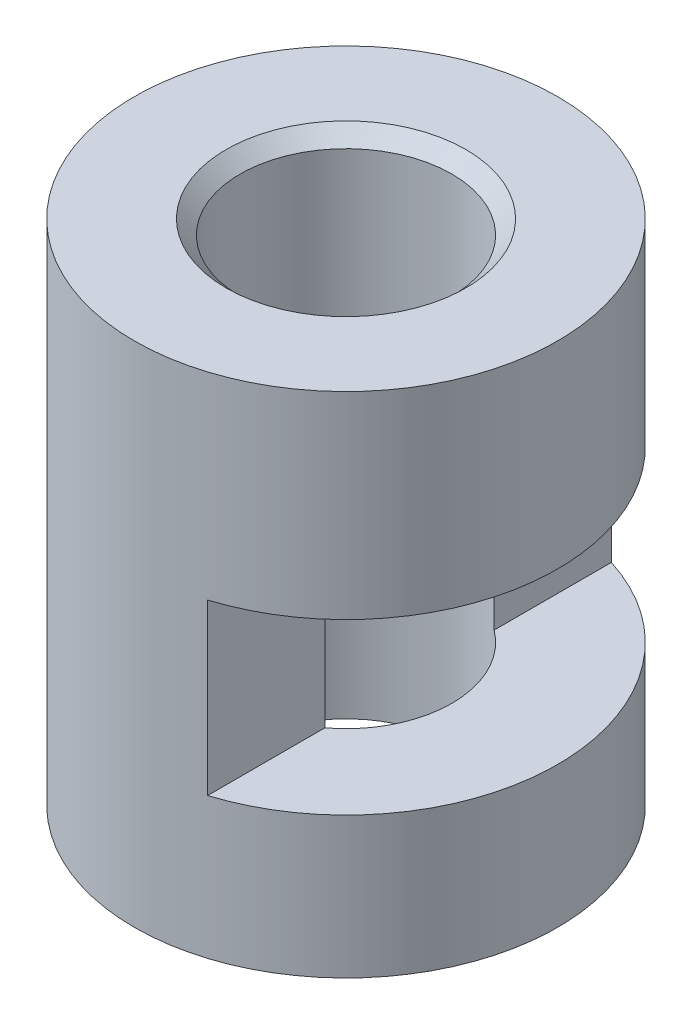
ISO-10303-21;
HEADER;
FILE_DESCRIPTION(('STEP AP214'),'2;1');
FILE_NAME('part.step','',(''),(''),'','','');
FILE_SCHEMA(('AUTOMOTIVE_DESIGN { 1 0 10303 214 1 1 1 1 }'));
ENDSEC;
DATA;
#1=APPLICATION_CONTEXT('core data for automotive mechanical design processes');
#2=APPLICATION_PROTOCOL_DEFINITION('international standard','automotive_design',2000,#1);
#3=PRODUCT_CONTEXT('',#1,'mechanical');
#4=PRODUCT('Part','Part','',(#3));
#5=PRODUCT_RELATED_PRODUCT_CATEGORY('part','',(#4));
#6=PRODUCT_DEFINITION_FORMATION('','',#4);
#7=PRODUCT_DEFINITION_CONTEXT('part definition',#1,'design');
#8=PRODUCT_DEFINITION('design','',#6,#7);
#9=PRODUCT_DEFINITION_SHAPE('','',#8);
#10=(LENGTH_UNIT() NAMED_UNIT(*) SI_UNIT(.MILLI.,.METRE.));
#11=(NAMED_UNIT(*) PLANE_ANGLE_UNIT() SI_UNIT($,.RADIAN.));
#12=(NAMED_UNIT(*) SI_UNIT($,.STERADIAN.) SOLID_ANGLE_UNIT());
#13=UNCERTAINTY_MEASURE_WITH_UNIT(LENGTH_MEASURE(1.E-05),#10,'distance_accuracy_value','');
#14=(GEOMETRIC_REPRESENTATION_CONTEXT(3) GLOBAL_UNCERTAINTY_ASSIGNED_CONTEXT((#13)) GLOBAL_UNIT_ASSIGNED_CONTEXT((#10,
#11,#12)) REPRESENTATION_CONTEXT('',''));
#15=CARTESIAN_POINT('',(0.,0.,0.));
#16=DIRECTION('',(0.,0.,1.));
#17=DIRECTION('',(1.,0.,0.));
#18=AXIS2_PLACEMENT_3D('',#15,#16,#17);
#19=CARTESIAN_POINT('',(0.,7.2,0.));
#20=DIRECTION('',(0.,-1.,0.));
#21=DIRECTION('',(0.,0.,-1.));
#22=AXIS2_PLACEMENT_3D('',#19,#20,#21);
#23=CYLINDRICAL_SURFACE('',#22,3.);
#24=DIRECTION('',(0.,-1.,0.));
#25=VECTOR('',#24,1.);
#26=CARTESIAN_POINT('',(0.899999999999999,7.2,2.86181760425084));
#27=LINE('',#26,#25);
#28=CARTESIAN_POINT('',(0.9,2.,2.86181760425084));
#29=VERTEX_POINT('',#28);
#30=CARTESIAN_POINT('',(0.899999999999999,4.4,2.86181760425084));
#31=VERTEX_POINT('',#30);
#32=EDGE_CURVE('E108',#29,#31,#27,.F.);
#33=ORIENTED_EDGE('',*,*,#32,.T.);
#34=CARTESIAN_POINT('',(0.,4.4,0.));
#35=DIRECTION('',(0.,1.,0.));
#36=DIRECTION('',(0.,0.,1.));
#37=AXIS2_PLACEMENT_3D('',#34,#35,#36);
#38=CIRCLE('',#37,3.);
#39=CARTESIAN_POINT('',(0.899999999999999,4.4,-2.86181760425084));
#40=VERTEX_POINT('',#39);
#41=EDGE_CURVE('E92',#31,#40,#38,.T.);
#42=ORIENTED_EDGE('',*,*,#41,.T.);
#43=DIRECTION('',(0.,-1.,0.));
#44=VECTOR('',#43,1.);
#45=CARTESIAN_POINT('',(0.899999999999999,7.2,-2.86181760425084));
#46=LINE('',#45,#44);
#47=CARTESIAN_POINT('',(0.9,2.,-2.86181760425084));
#48=VERTEX_POINT('',#47);
#49=EDGE_CURVE('E99',#40,#48,#46,.T.);
#50=ORIENTED_EDGE('',*,*,#49,.T.);
#51=CARTESIAN_POINT('',(0.,2.,0.));
#52=DIRECTION('',(0.,-1.,0.));
#53=DIRECTION('',(0.,0.,-1.));
#54=AXIS2_PLACEMENT_3D('',#51,#52,#53);
#55=CIRCLE('',#54,3.);
#56=EDGE_CURVE('E64',#48,#29,#55,.T.);
#57=ORIENTED_EDGE('',*,*,#56,.T.);
#58=EDGE_LOOP('',(#33,#42,#50,#57));
#59=FACE_BOUND('',#58,.T.);
#60=CARTESIAN_POINT('',(0.,7.2,0.));
#61=DIRECTION('',(0.,1.,0.));
#62=DIRECTION('',(0.,0.,1.));
#63=AXIS2_PLACEMENT_3D('',#60,#61,#62);
#64=CIRCLE('',#63,3.);
#65=CARTESIAN_POINT('',(0.,7.2,3.));
#66=VERTEX_POINT('',#65);
#67=EDGE_CURVE('E116',#66,#66,#64,.T.);
#68=ORIENTED_EDGE('',*,*,#67,.F.);
#69=EDGE_LOOP('',(#68));
#70=FACE_BOUND('',#69,.T.);
#71=CARTESIAN_POINT('',(0.,0.,0.));
#72=DIRECTION('',(0.,1.,0.));
#73=DIRECTION('',(0.,0.,1.));
#74=AXIS2_PLACEMENT_3D('',#71,#72,#73);
#75=CIRCLE('',#74,3.);
#76=CARTESIAN_POINT('',(0.,0.,3.));
#77=VERTEX_POINT('',#76);
#78=EDGE_CURVE('E111',#77,#77,#75,.T.);
#79=ORIENTED_EDGE('',*,*,#78,.T.);
#80=EDGE_LOOP('',(#79));
#81=FACE_BOUND('',#80,.T.);
#82=ADVANCED_FACE('F49',(#59,#70,#81),#23,.T.);
#83=CARTESIAN_POINT('',(0.,7.2,0.));
#84=DIRECTION('',(0.,1.,0.));
#85=DIRECTION('',(0.,0.,1.));
#86=AXIS2_PLACEMENT_3D('',#83,#84,#85);
#87=PLANE('',#86);
#88=CARTESIAN_POINT('',(0.,7.2,0.));
#89=DIRECTION('',(0.,1.,0.));
#90=DIRECTION('',(0.,0.,1.));
#91=AXIS2_PLACEMENT_3D('',#88,#89,#90);
#92=CIRCLE('',#91,1.7);
#93=CARTESIAN_POINT('',(0.,7.2,1.7));
#94=VERTEX_POINT('',#93);
#95=EDGE_CURVE('E13',#94,#94,#92,.F.);
#96=ORIENTED_EDGE('',*,*,#95,.T.);
#97=EDGE_LOOP('',(#96));
#98=FACE_BOUND('',#97,.T.);
#99=ORIENTED_EDGE('',*,*,#67,.T.);
#100=EDGE_LOOP('',(#99));
#101=FACE_BOUND('',#100,.T.);
#102=ADVANCED_FACE('F144',(#98,#101),#87,.T.);
#103=CARTESIAN_POINT('',(0.,0.,0.));
#104=DIRECTION('',(0.,1.,0.));
#105=DIRECTION('',(0.,0.,1.));
#106=AXIS2_PLACEMENT_3D('',#103,#104,#105);
#107=PLANE('',#106);
#108=CARTESIAN_POINT('',(0.,0.,0.));
#109=DIRECTION('',(0.,1.,0.));
#110=DIRECTION('',(0.,0.,1.));
#111=AXIS2_PLACEMENT_3D('',#108,#109,#110);
#112=CIRCLE('',#111,1.5);
#113=CARTESIAN_POINT('',(0.,0.,1.5));
#114=VERTEX_POINT('',#113);
#115=EDGE_CURVE('E107',#114,#114,#112,.F.);
#116=ORIENTED_EDGE('',*,*,#115,.F.);
#117=EDGE_LOOP('',(#116));
#118=FACE_BOUND('',#117,.T.);
#119=ORIENTED_EDGE('',*,*,#78,.F.);
#120=EDGE_LOOP('',(#119));
#121=FACE_BOUND('',#120,.T.);
#122=ADVANCED_FACE('F148',(#118,#121),#107,.F.);
#123=CARTESIAN_POINT('',(0.,-0.00100000000000013,0.));
#124=DIRECTION('',(0.,1.,0.));
#125=DIRECTION('',(0.,0.,1.));
#126=AXIS2_PLACEMENT_3D('',#123,#124,#125);
#127=CYLINDRICAL_SURFACE('',#126,1.5);
#128=CARTESIAN_POINT('',(0.,7.,0.));
#129=DIRECTION('',(0.,1.,0.));
#130=DIRECTION('',(0.,0.,1.));
#131=AXIS2_PLACEMENT_3D('',#128,#129,#130);
#132=CIRCLE('',#131,1.5);
#133=CARTESIAN_POINT('',(0.,7.,1.5));
#134=VERTEX_POINT('',#133);
#135=EDGE_CURVE('E57',#134,#134,#132,.T.);
#136=ORIENTED_EDGE('',*,*,#135,.T.);
#137=EDGE_LOOP('',(#136));
#138=FACE_BOUND('',#137,.T.);
#139=DIRECTION('',(0.,1.,0.));
#140=VECTOR('',#139,1.);
#141=CARTESIAN_POINT('',(0.9,-0.00100000000000001,-1.2));
#142=LINE('',#141,#140);
#143=CARTESIAN_POINT('',(0.9,2.,-1.2));
#144=VERTEX_POINT('',#143);
#145=CARTESIAN_POINT('',(0.899999999999999,4.4,-1.2));
#146=VERTEX_POINT('',#145);
#147=EDGE_CURVE('E102',#144,#146,#142,.T.);
#148=ORIENTED_EDGE('',*,*,#147,.T.);
#149=CARTESIAN_POINT('',(0.,4.4,0.));
#150=DIRECTION('',(0.,1.,0.));
#151=DIRECTION('',(0.,0.,1.));
#152=AXIS2_PLACEMENT_3D('',#149,#150,#151);
#153=CIRCLE('',#152,1.5);
#154=CARTESIAN_POINT('',(0.899999999999999,4.4,1.2));
#155=VERTEX_POINT('',#154);
#156=EDGE_CURVE('E127',#146,#155,#153,.F.);
#157=ORIENTED_EDGE('',*,*,#156,.T.);
#158=DIRECTION('',(0.,1.,0.));
#159=VECTOR('',#158,1.);
#160=CARTESIAN_POINT('',(0.9,-0.00100000000000001,1.2));
#161=LINE('',#160,#159);
#162=CARTESIAN_POINT('',(0.9,2.,1.2));
#163=VERTEX_POINT('',#162);
#164=EDGE_CURVE('E124',#155,#163,#161,.F.);
#165=ORIENTED_EDGE('',*,*,#164,.T.);
#166=CARTESIAN_POINT('',(0.,2.,0.));
#167=DIRECTION('',(0.,-1.,0.));
#168=DIRECTION('',(0.,0.,-1.));
#169=AXIS2_PLACEMENT_3D('',#166,#167,#168);
#170=CIRCLE('',#169,1.5);
#171=EDGE_CURVE('E119',#163,#144,#170,.F.);
#172=ORIENTED_EDGE('',*,*,#171,.T.);
#173=EDGE_LOOP('',(#148,#157,#165,#172));
#174=FACE_BOUND('',#173,.T.);
#175=ORIENTED_EDGE('',*,*,#115,.T.);
#176=EDGE_LOOP('',(#175));
#177=FACE_BOUND('',#176,.T.);
#178=ADVANCED_FACE('F132',(#138,#174,#177),#127,.F.);
#179=CARTESIAN_POINT('',(0.9,4.4,-3.));
#180=DIRECTION('',(-1.,0.,0.));
#181=DIRECTION('',(0.,-1.,0.));
#182=AXIS2_PLACEMENT_3D('',#179,#180,#181);
#183=PLANE('',#182);
#184=DIRECTION('',(0.,0.,1.));
#185=VECTOR('',#184,1.);
#186=CARTESIAN_POINT('',(0.9,4.4,-3.));
#187=LINE('',#186,#185);
#188=EDGE_CURVE('E93',#40,#146,#187,.T.);
#189=ORIENTED_EDGE('',*,*,#188,.T.);
#190=ORIENTED_EDGE('',*,*,#147,.F.);
#191=DIRECTION('',(0.,0.,1.));
#192=VECTOR('',#191,1.);
#193=CARTESIAN_POINT('',(0.9,2.,-3.));
#194=LINE('',#193,#192);
#195=EDGE_CURVE('E71',#48,#144,#194,.T.);
#196=ORIENTED_EDGE('',*,*,#195,.F.);
#197=ORIENTED_EDGE('',*,*,#49,.F.);
#198=EDGE_LOOP('',(#189,#190,#196,#197));
#199=FACE_BOUND('',#198,.T.);
#200=ADVANCED_FACE('F98',(#199),#183,.F.);
#201=EDGE_CURVE('E90',#163,#29,#194,.T.);
#202=ORIENTED_EDGE('',*,*,#201,.F.);
#203=ORIENTED_EDGE('',*,*,#164,.F.);
#204=EDGE_CURVE('E104',#155,#31,#187,.T.);
#205=ORIENTED_EDGE('',*,*,#204,.T.);
#206=ORIENTED_EDGE('',*,*,#32,.F.);
#207=EDGE_LOOP('',(#202,#203,#205,#206));
#208=FACE_BOUND('',#207,.T.);
#209=ADVANCED_FACE('F158',(#208),#183,.F.);
#210=CARTESIAN_POINT('',(0.9,4.4,-3.));
#211=DIRECTION('',(0.,1.,0.));
#212=DIRECTION('',(0.,0.,1.));
#213=AXIS2_PLACEMENT_3D('',#210,#211,#212);
#214=PLANE('',#213);
#215=ORIENTED_EDGE('',*,*,#204,.F.);
#216=ORIENTED_EDGE('',*,*,#156,.F.);
#217=ORIENTED_EDGE('',*,*,#188,.F.);
#218=ORIENTED_EDGE('',*,*,#41,.F.);
#219=EDGE_LOOP('',(#215,#216,#217,#218));
#220=FACE_BOUND('',#219,.T.);
#221=ADVANCED_FACE('F140',(#220),#214,.F.);
#222=CARTESIAN_POINT('',(0.9,2.,-3.));
#223=DIRECTION('',(0.,-1.,0.));
#224=DIRECTION('',(0.,0.,-1.));
#225=AXIS2_PLACEMENT_3D('',#222,#223,#224);
#226=PLANE('',#225);
#227=ORIENTED_EDGE('',*,*,#195,.T.);
#228=ORIENTED_EDGE('',*,*,#171,.F.);
#229=ORIENTED_EDGE('',*,*,#201,.T.);
#230=ORIENTED_EDGE('',*,*,#56,.F.);
#231=EDGE_LOOP('',(#227,#228,#229,#230));
#232=FACE_BOUND('',#231,.T.);
#233=ADVANCED_FACE('F88',(#232),#226,.F.);
#234=CARTESIAN_POINT('',(0.,7.,0.));
#235=DIRECTION('',(0.,1.,0.));
#236=DIRECTION('',(0.,0.,1.));
#237=AXIS2_PLACEMENT_3D('',#234,#235,#236);
#238=CONICAL_SURFACE('',#237,1.5,0.785398163397453);
#239=ORIENTED_EDGE('',*,*,#95,.F.);
#240=EDGE_LOOP('',(#239));
#241=FACE_BOUND('',#240,.T.);
#242=ORIENTED_EDGE('',*,*,#135,.F.);
#243=EDGE_LOOP('',(#242));
#244=FACE_BOUND('',#243,.T.);
#245=ADVANCED_FACE('F51',(#241,#244),#238,.F.);
#246=CLOSED_SHELL('',(#82,#102,#122,#178,#200,#209,#221,#233,#245));
#247=MANIFOLD_SOLID_BREP('B2',#246);
#248=ADVANCED_BREP_SHAPE_REPRESENTATION('',(#18,#247),#14);
#249=SHAPE_DEFINITION_REPRESENTATION(#9,#248);
ENDSEC;
END-ISO-10303-21;
